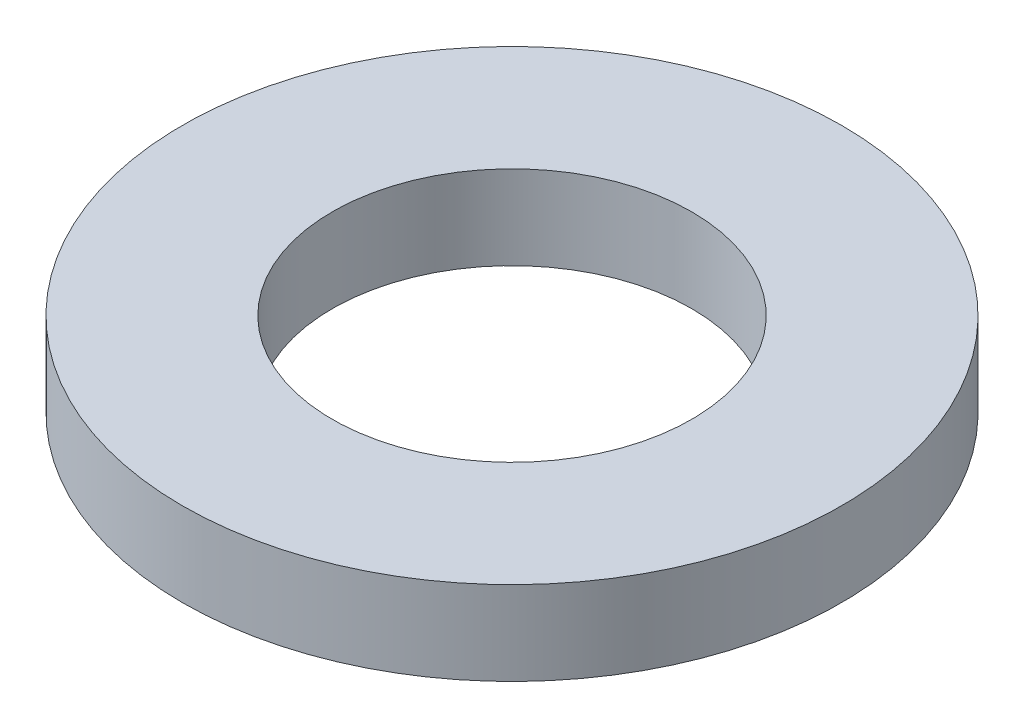
ISO-10303-21;
HEADER;
FILE_DESCRIPTION(('STEP AP214'),'2;1');
FILE_NAME('part.step','',(''),(''),'','','');
FILE_SCHEMA(('AUTOMOTIVE_DESIGN { 1 0 10303 214 1 1 1 1 }'));
ENDSEC;
DATA;
#1=APPLICATION_CONTEXT('core data for automotive mechanical design processes');
#2=APPLICATION_PROTOCOL_DEFINITION('international standard','automotive_design',2000,#1);
#3=PRODUCT_CONTEXT('',#1,'mechanical');
#4=PRODUCT('Part','Part','',(#3));
#5=PRODUCT_RELATED_PRODUCT_CATEGORY('part','',(#4));
#6=PRODUCT_DEFINITION_FORMATION('','',#4);
#7=PRODUCT_DEFINITION_CONTEXT('part definition',#1,'design');
#8=PRODUCT_DEFINITION('design','',#6,#7);
#9=PRODUCT_DEFINITION_SHAPE('','',#8);
#10=(LENGTH_UNIT() NAMED_UNIT(*) SI_UNIT(.MILLI.,.METRE.));
#11=(NAMED_UNIT(*) PLANE_ANGLE_UNIT() SI_UNIT($,.RADIAN.));
#12=(NAMED_UNIT(*) SI_UNIT($,.STERADIAN.) SOLID_ANGLE_UNIT());
#13=UNCERTAINTY_MEASURE_WITH_UNIT(LENGTH_MEASURE(1.E-05),#10,'distance_accuracy_value','');
#14=(GEOMETRIC_REPRESENTATION_CONTEXT(3) GLOBAL_UNCERTAINTY_ASSIGNED_CONTEXT((#13)) GLOBAL_UNIT_ASSIGNED_CONTEXT((#10,
#11,#12)) REPRESENTATION_CONTEXT('',''));
#15=CARTESIAN_POINT('',(0.,0.,0.));
#16=DIRECTION('',(0.,0.,1.));
#17=DIRECTION('',(1.,0.,0.));
#18=AXIS2_PLACEMENT_3D('',#15,#16,#17);
#19=CARTESIAN_POINT('',(0.,21.,0.));
#20=DIRECTION('',(0.,-1.,0.));
#21=DIRECTION('',(0.,0.,-1.));
#22=AXIS2_PLACEMENT_3D('',#19,#20,#21);
#23=CYLINDRICAL_SURFACE('',#22,82.5);
#24=CARTESIAN_POINT('',(0.,21.,0.));
#25=DIRECTION('',(0.,1.,0.));
#26=DIRECTION('',(0.,0.,1.));
#27=AXIS2_PLACEMENT_3D('',#24,#25,#26);
#28=CIRCLE('',#27,82.5);
#29=CARTESIAN_POINT('',(0.,21.,-82.5));
#30=VERTEX_POINT('',#29);
#31=EDGE_CURVE('E10',#30,#30,#28,.T.);
#32=CARTESIAN_POINT('',(0.,0.,0.));
#33=DIRECTION('',(0.,1.,0.));
#34=DIRECTION('',(0.,0.,1.));
#35=AXIS2_PLACEMENT_3D('',#32,#33,#34);
#36=CIRCLE('',#35,82.5);
#37=CARTESIAN_POINT('',(0.,0.,-82.5));
#38=VERTEX_POINT('',#37);
#39=EDGE_CURVE('E37',#38,#38,#36,.T.);
#40=CARTESIAN_POINT('',(0.,21.,-82.5));
#41=CARTESIAN_POINT('',(0.,20.78125,-82.5));
#42=CARTESIAN_POINT('',(0.,20.5625,-82.5));
#43=CARTESIAN_POINT('',(0.,20.125,-82.5));
#44=CARTESIAN_POINT('',(0.,19.90625,-82.5));
#45=CARTESIAN_POINT('',(0.,19.46875,-82.5));
#46=CARTESIAN_POINT('',(0.,19.25,-82.5));
#47=CARTESIAN_POINT('',(0.,18.8125,-82.5));
#48=CARTESIAN_POINT('',(0.,18.59375,-82.5));
#49=CARTESIAN_POINT('',(0.,18.15625,-82.5));
#50=CARTESIAN_POINT('',(0.,17.9375,-82.5));
#51=CARTESIAN_POINT('',(0.,17.5,-82.5));
#52=CARTESIAN_POINT('',(0.,17.28125,-82.5));
#53=CARTESIAN_POINT('',(0.,16.84375,-82.5));
#54=CARTESIAN_POINT('',(0.,16.625,-82.5));
#55=CARTESIAN_POINT('',(0.,16.1875,-82.5));
#56=CARTESIAN_POINT('',(0.,15.96875,-82.5));
#57=CARTESIAN_POINT('',(0.,15.53125,-82.5));
#58=CARTESIAN_POINT('',(0.,15.3125,-82.5));
#59=CARTESIAN_POINT('',(0.,14.875,-82.5));
#60=CARTESIAN_POINT('',(0.,14.65625,-82.5));
#61=CARTESIAN_POINT('',(0.,14.21875,-82.5));
#62=CARTESIAN_POINT('',(0.,14.,-82.5));
#63=CARTESIAN_POINT('',(0.,13.5625,-82.5));
#64=CARTESIAN_POINT('',(0.,13.34375,-82.5));
#65=CARTESIAN_POINT('',(0.,12.90625,-82.5));
#66=CARTESIAN_POINT('',(0.,12.6875,-82.5));
#67=CARTESIAN_POINT('',(0.,12.25,-82.5));
#68=CARTESIAN_POINT('',(0.,12.03125,-82.5));
#69=CARTESIAN_POINT('',(0.,11.59375,-82.5));
#70=CARTESIAN_POINT('',(0.,11.375,-82.5));
#71=CARTESIAN_POINT('',(0.,10.9375,-82.5));
#72=CARTESIAN_POINT('',(0.,10.71875,-82.5));
#73=CARTESIAN_POINT('',(0.,10.28125,-82.5));
#74=CARTESIAN_POINT('',(0.,10.0625,-82.5));
#75=CARTESIAN_POINT('',(0.,9.625,-82.5));
#76=CARTESIAN_POINT('',(0.,9.40625,-82.5));
#77=CARTESIAN_POINT('',(0.,8.96875,-82.5));
#78=CARTESIAN_POINT('',(0.,8.75,-82.5));
#79=CARTESIAN_POINT('',(0.,8.3125,-82.5));
#80=CARTESIAN_POINT('',(0.,8.09375,-82.5));
#81=CARTESIAN_POINT('',(0.,7.65625,-82.5));
#82=CARTESIAN_POINT('',(0.,7.4375,-82.5));
#83=CARTESIAN_POINT('',(0.,7.,-82.5));
#84=CARTESIAN_POINT('',(0.,6.78125,-82.5));
#85=CARTESIAN_POINT('',(0.,6.34375,-82.5));
#86=CARTESIAN_POINT('',(0.,6.125,-82.5));
#87=CARTESIAN_POINT('',(0.,5.6875,-82.5));
#88=CARTESIAN_POINT('',(0.,5.46875,-82.5));
#89=CARTESIAN_POINT('',(0.,5.03125,-82.5));
#90=CARTESIAN_POINT('',(0.,4.8125,-82.5));
#91=CARTESIAN_POINT('',(0.,4.375,-82.5));
#92=CARTESIAN_POINT('',(0.,4.15625,-82.5));
#93=CARTESIAN_POINT('',(0.,3.71875,-82.5));
#94=CARTESIAN_POINT('',(0.,3.5,-82.5));
#95=CARTESIAN_POINT('',(0.,3.0625,-82.5));
#96=CARTESIAN_POINT('',(0.,2.84375,-82.5));
#97=CARTESIAN_POINT('',(0.,2.40625,-82.5));
#98=CARTESIAN_POINT('',(0.,2.1875,-82.5));
#99=CARTESIAN_POINT('',(0.,1.75,-82.5));
#100=CARTESIAN_POINT('',(0.,1.53125,-82.5));
#101=CARTESIAN_POINT('',(0.,1.09375,-82.5));
#102=CARTESIAN_POINT('',(0.,0.875000000000001,-82.5));
#103=CARTESIAN_POINT('',(0.,0.4375,-82.5));
#104=CARTESIAN_POINT('',(0.,0.21875,-82.5));
#105=CARTESIAN_POINT('',(0.,0.,-82.5));
#106=B_SPLINE_CURVE_WITH_KNOTS('',3,(#40,#41,#42,#43,#44,#45,#46,#47,#48,#49,#50,#51,#52,#53,
#54,#55,#56,#57,#58,#59,#60,#61,#62,#63,#64,#65,#66,#67,#68,#69,#70,#71,#72,#73,#74,#75,#76,#77,
#78,#79,#80,#81,#82,#83,#84,#85,#86,#87,#88,#89,#90,#91,#92,#93,#94,#95,#96,#97,#98,#99,#100,
#101,#102,#103,#104,#105),.UNSPECIFIED.,.F.,.F.,(4,2,2,2,2,2,2,2,2,2,2,2,2,2,2,2,2,2,2,2,2,2,2,
2,2,2,2,2,2,2,2,2,4),(0.,0.656249999999997,1.3125,1.96875,2.625,3.28125,3.9375,4.59375,5.25,
5.90625,6.5625,7.21875,7.875,8.53125,9.1875,9.84375,10.5,11.15625,11.8125,12.46875,13.125,
13.78125,14.4375,15.09375,15.75,16.40625,17.0625,17.71875,18.375,19.03125,19.6875,20.34375,21.),.UNSPECIFIED.);
#107=EDGE_CURVE('BSEAM40',#30,#38,#106,.T.);
#108=ORIENTED_EDGE('',*,*,#31,.F.);
#109=ORIENTED_EDGE('',*,*,#39,.T.);
#110=ORIENTED_EDGE('',*,*,#107,.T.);
#111=ORIENTED_EDGE('',*,*,#107,.F.);
#112=EDGE_LOOP('',(#108,#110,#109,#111));
#113=FACE_BOUND('',#112,.T.);
#114=ADVANCED_FACE('F40',(#113),#23,.T.);
#115=CARTESIAN_POINT('',(0.,21.,0.));
#116=DIRECTION('',(0.,1.,0.));
#117=DIRECTION('',(0.,0.,1.));
#118=AXIS2_PLACEMENT_3D('',#115,#116,#117);
#119=PLANE('',#118);
#120=CARTESIAN_POINT('',(0.,21.,0.));
#121=DIRECTION('',(0.,1.,0.));
#122=DIRECTION('',(0.,0.,1.));
#123=AXIS2_PLACEMENT_3D('',#120,#121,#122);
#124=CIRCLE('',#123,45.);
#125=CARTESIAN_POINT('',(0.,21.,-45.));
#126=VERTEX_POINT('',#125);
#127=EDGE_CURVE('E50',#126,#126,#124,.T.);
#128=ORIENTED_EDGE('',*,*,#127,.F.);
#129=EDGE_LOOP('',(#128));
#130=FACE_BOUND('',#129,.T.);
#131=ORIENTED_EDGE('',*,*,#31,.T.);
#132=EDGE_LOOP('',(#131));
#133=FACE_BOUND('',#132,.T.);
#134=ADVANCED_FACE('F59',(#130,#133),#119,.T.);
#135=CARTESIAN_POINT('',(0.,0.,0.));
#136=DIRECTION('',(0.,1.,0.));
#137=DIRECTION('',(0.,0.,1.));
#138=AXIS2_PLACEMENT_3D('',#135,#136,#137);
#139=PLANE('',#138);
#140=CARTESIAN_POINT('',(0.,0.,0.));
#141=DIRECTION('',(0.,1.,0.));
#142=DIRECTION('',(0.,0.,1.));
#143=AXIS2_PLACEMENT_3D('',#140,#141,#142);
#144=CIRCLE('',#143,45.);
#145=CARTESIAN_POINT('',(0.,0.,-45.));
#146=VERTEX_POINT('',#145);
#147=EDGE_CURVE('E47',#146,#146,#144,.T.);
#148=ORIENTED_EDGE('',*,*,#147,.T.);
#149=EDGE_LOOP('',(#148));
#150=FACE_BOUND('',#149,.T.);
#151=ORIENTED_EDGE('',*,*,#39,.F.);
#152=EDGE_LOOP('',(#151));
#153=FACE_BOUND('',#152,.T.);
#154=ADVANCED_FACE('F58',(#150,#153),#139,.F.);
#155=CARTESIAN_POINT('',(0.,21.,0.));
#156=DIRECTION('',(0.,-1.,0.));
#157=DIRECTION('',(0.,0.,-1.));
#158=AXIS2_PLACEMENT_3D('',#155,#156,#157);
#159=CYLINDRICAL_SURFACE('',#158,45.);
#160=CARTESIAN_POINT('',(0.,21.,-45.));
#161=CARTESIAN_POINT('',(0.,20.78125,-45.));
#162=CARTESIAN_POINT('',(0.,20.5625,-45.));
#163=CARTESIAN_POINT('',(0.,20.125,-45.));
#164=CARTESIAN_POINT('',(0.,19.90625,-45.));
#165=CARTESIAN_POINT('',(0.,19.46875,-45.));
#166=CARTESIAN_POINT('',(0.,19.25,-45.));
#167=CARTESIAN_POINT('',(0.,18.8125,-45.));
#168=CARTESIAN_POINT('',(0.,18.59375,-45.));
#169=CARTESIAN_POINT('',(0.,18.15625,-45.));
#170=CARTESIAN_POINT('',(0.,17.9375,-45.));
#171=CARTESIAN_POINT('',(0.,17.5,-45.));
#172=CARTESIAN_POINT('',(0.,17.28125,-45.));
#173=CARTESIAN_POINT('',(0.,16.84375,-45.));
#174=CARTESIAN_POINT('',(0.,16.625,-45.));
#175=CARTESIAN_POINT('',(0.,16.1875,-45.));
#176=CARTESIAN_POINT('',(0.,15.96875,-45.));
#177=CARTESIAN_POINT('',(0.,15.53125,-45.));
#178=CARTESIAN_POINT('',(0.,15.3125,-45.));
#179=CARTESIAN_POINT('',(0.,14.875,-45.));
#180=CARTESIAN_POINT('',(0.,14.65625,-45.));
#181=CARTESIAN_POINT('',(0.,14.21875,-45.));
#182=CARTESIAN_POINT('',(0.,14.,-45.));
#183=CARTESIAN_POINT('',(0.,13.5625,-45.));
#184=CARTESIAN_POINT('',(0.,13.34375,-45.));
#185=CARTESIAN_POINT('',(0.,12.90625,-45.));
#186=CARTESIAN_POINT('',(0.,12.6875,-45.));
#187=CARTESIAN_POINT('',(0.,12.25,-45.));
#188=CARTESIAN_POINT('',(0.,12.03125,-45.));
#189=CARTESIAN_POINT('',(0.,11.59375,-45.));
#190=CARTESIAN_POINT('',(0.,11.375,-45.));
#191=CARTESIAN_POINT('',(0.,10.9375,-45.));
#192=CARTESIAN_POINT('',(0.,10.71875,-45.));
#193=CARTESIAN_POINT('',(0.,10.28125,-45.));
#194=CARTESIAN_POINT('',(0.,10.0625,-45.));
#195=CARTESIAN_POINT('',(0.,9.625,-45.));
#196=CARTESIAN_POINT('',(0.,9.40625,-45.));
#197=CARTESIAN_POINT('',(0.,8.96875,-45.));
#198=CARTESIAN_POINT('',(0.,8.75,-45.));
#199=CARTESIAN_POINT('',(0.,8.3125,-45.));
#200=CARTESIAN_POINT('',(0.,8.09375,-45.));
#201=CARTESIAN_POINT('',(0.,7.65625,-45.));
#202=CARTESIAN_POINT('',(0.,7.4375,-45.));
#203=CARTESIAN_POINT('',(0.,7.,-45.));
#204=CARTESIAN_POINT('',(0.,6.78125,-45.));
#205=CARTESIAN_POINT('',(0.,6.34375,-45.));
#206=CARTESIAN_POINT('',(0.,6.125,-45.));
#207=CARTESIAN_POINT('',(0.,5.6875,-45.));
#208=CARTESIAN_POINT('',(0.,5.46875,-45.));
#209=CARTESIAN_POINT('',(0.,5.03125,-45.));
#210=CARTESIAN_POINT('',(0.,4.8125,-45.));
#211=CARTESIAN_POINT('',(0.,4.375,-45.));
#212=CARTESIAN_POINT('',(0.,4.15625,-45.));
#213=CARTESIAN_POINT('',(0.,3.71875,-45.));
#214=CARTESIAN_POINT('',(0.,3.5,-45.));
#215=CARTESIAN_POINT('',(0.,3.0625,-45.));
#216=CARTESIAN_POINT('',(0.,2.84375,-45.));
#217=CARTESIAN_POINT('',(0.,2.40625,-45.));
#218=CARTESIAN_POINT('',(0.,2.1875,-45.));
#219=CARTESIAN_POINT('',(0.,1.75,-45.));
#220=CARTESIAN_POINT('',(0.,1.53125,-45.));
#221=CARTESIAN_POINT('',(0.,1.09375,-45.));
#222=CARTESIAN_POINT('',(0.,0.875000000000001,-45.));
#223=CARTESIAN_POINT('',(0.,0.4375,-45.));
#224=CARTESIAN_POINT('',(0.,0.21875,-45.));
#225=CARTESIAN_POINT('',(0.,0.,-45.));
#226=B_SPLINE_CURVE_WITH_KNOTS('',3,(#160,#161,#162,#163,#164,#165,#166,#167,#168,#169,#170,
#171,#172,#173,#174,#175,#176,#177,#178,#179,#180,#181,#182,#183,#184,#185,#186,#187,#188,#189,
#190,#191,#192,#193,#194,#195,#196,#197,#198,#199,#200,#201,#202,#203,#204,#205,#206,#207,#208,
#209,#210,#211,#212,#213,#214,#215,#216,#217,#218,#219,#220,#221,#222,#223,#224,#225),
.UNSPECIFIED.,.F.,.F.,(4,2,2,2,2,2,2,2,2,2,2,2,2,2,2,2,2,2,2,2,2,2,2,2,2,2,2,2,2,2,2,2,4),(0.,
0.656250000000001,1.3125,1.96875,2.625,3.28125,3.9375,4.59375,5.25,5.90625,6.5625,7.21875,7.875,
8.53125,9.1875,9.84375,10.5,11.15625,11.8125,12.46875,13.125,13.78125,14.4375,15.09375,15.75,
16.40625,17.0625,17.71875,18.375,19.03125,19.6875,20.34375,21.),.UNSPECIFIED.);
#227=EDGE_CURVE('BSEAM54',#126,#146,#226,.T.);
#228=ORIENTED_EDGE('',*,*,#127,.T.);
#229=ORIENTED_EDGE('',*,*,#147,.F.);
#230=ORIENTED_EDGE('',*,*,#227,.T.);
#231=ORIENTED_EDGE('',*,*,#227,.F.);
#232=EDGE_LOOP('',(#228,#230,#229,#231));
#233=FACE_BOUND('',#232,.T.);
#234=ADVANCED_FACE('F54',(#233),#159,.F.);
#235=CLOSED_SHELL('',(#114,#134,#154,#234));
#236=MANIFOLD_SOLID_BREP('B2',#235);
#237=ADVANCED_BREP_SHAPE_REPRESENTATION('',(#18,#236),#14);
#238=SHAPE_DEFINITION_REPRESENTATION(#9,#237);
ENDSEC;
END-ISO-10303-21;
